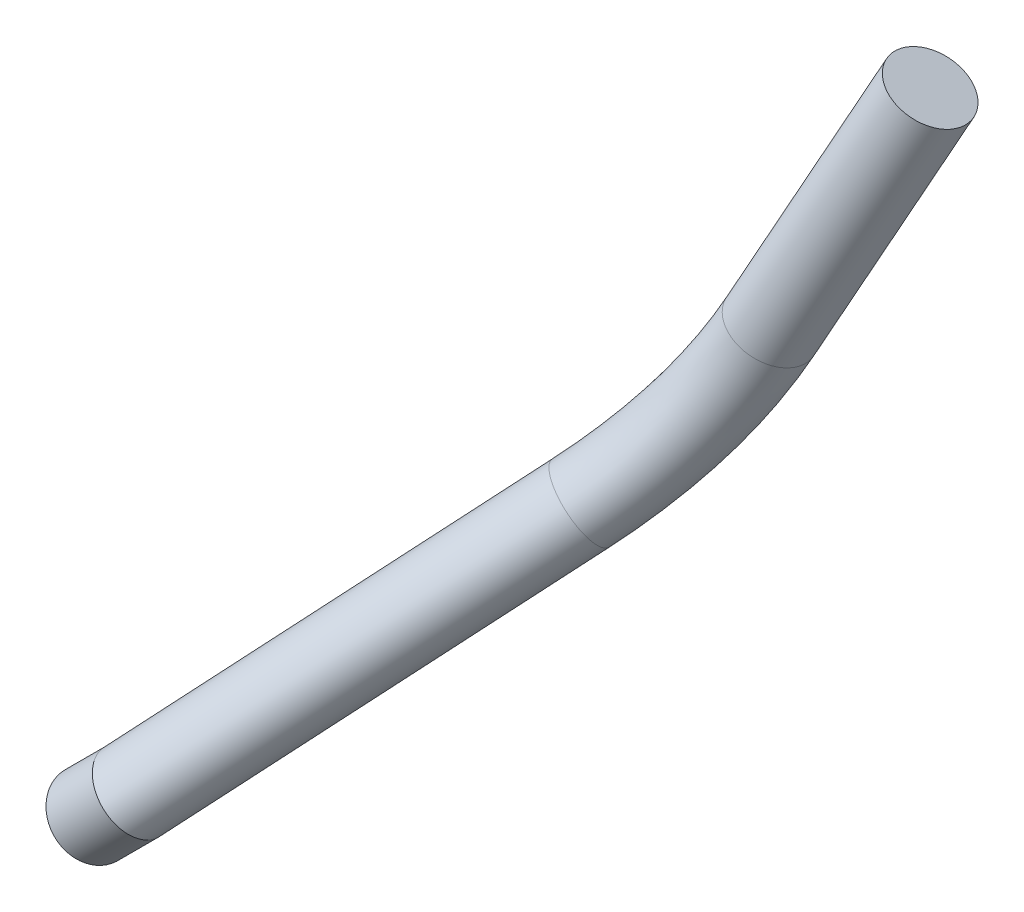
ISO-10303-21;
HEADER;
FILE_DESCRIPTION(('STEP AP214'),'2;1');
FILE_NAME('part.step','',(''),(''),'','','');
FILE_SCHEMA(('AUTOMOTIVE_DESIGN { 1 0 10303 214 1 1 1 1 }'));
ENDSEC;
DATA;
#1=APPLICATION_CONTEXT('core data for automotive mechanical design processes');
#2=APPLICATION_PROTOCOL_DEFINITION('international standard','automotive_design',2000,#1);
#3=PRODUCT_CONTEXT('',#1,'mechanical');
#4=PRODUCT('Part','Part','',(#3));
#5=PRODUCT_RELATED_PRODUCT_CATEGORY('part','',(#4));
#6=PRODUCT_DEFINITION_FORMATION('','',#4);
#7=PRODUCT_DEFINITION_CONTEXT('part definition',#1,'design');
#8=PRODUCT_DEFINITION('design','',#6,#7);
#9=PRODUCT_DEFINITION_SHAPE('','',#8);
#10=(LENGTH_UNIT() NAMED_UNIT(*) SI_UNIT(.MILLI.,.METRE.));
#11=(NAMED_UNIT(*) PLANE_ANGLE_UNIT() SI_UNIT($,.RADIAN.));
#12=(NAMED_UNIT(*) SI_UNIT($,.STERADIAN.) SOLID_ANGLE_UNIT());
#13=UNCERTAINTY_MEASURE_WITH_UNIT(LENGTH_MEASURE(1.E-05),#10,'distance_accuracy_value','');
#14=(GEOMETRIC_REPRESENTATION_CONTEXT(3) GLOBAL_UNCERTAINTY_ASSIGNED_CONTEXT((#13)) GLOBAL_UNIT_ASSIGNED_CONTEXT((#10,
#11,#12)) REPRESENTATION_CONTEXT('',''));
#15=CARTESIAN_POINT('',(0.,0.,0.));
#16=DIRECTION('',(0.,0.,1.));
#17=DIRECTION('',(1.,0.,0.));
#18=AXIS2_PLACEMENT_3D('',#15,#16,#17);
#19=CARTESIAN_POINT('',(193.010891229428,77.9168547777323,208.7608));
#20=DIRECTION('',(0.707106781186756,0.707106781186339,3.13292330996247E-13));
#21=DIRECTION('',(-0.707106781186339,0.707106781186756,0.));
#22=AXIS2_PLACEMENT_3D('',#19,#20,#21);
#23=PLANE('',#22);
#24=CARTESIAN_POINT('',(193.010891229428,77.9168547777323,208.7608));
#25=DIRECTION('',(0.707106781186756,0.707106781186339,3.13292330996247E-13));
#26=DIRECTION('',(-0.707106781186339,0.707106781186756,0.));
#27=AXIS2_PLACEMENT_3D('',#24,#25,#26);
#28=CIRCLE('',#27,4.69900000000001);
#29=CARTESIAN_POINT('',(189.688196464634,81.2395495425288,208.7608));
#30=VERTEX_POINT('',#29);
#31=EDGE_CURVE('E48',#30,#30,#28,.T.);
#32=ORIENTED_EDGE('',*,*,#31,.F.);
#33=EDGE_LOOP('',(#32));
#34=FACE_BOUND('',#33,.T.);
#35=ADVANCED_FACE('F45',(#34),#23,.F.);
#36=CARTESIAN_POINT('',(253.620262853488,165.140017683346,163.321796800787));
#37=DIRECTION('',(0.428619655044023,0.890066110551967,-0.155137068932078));
#38=DIRECTION('',(-0.884787750148492,0.448267243214211,0.127307171236739));
#39=AXIS2_PLACEMENT_3D('',#36,#37,#38);
#40=PLANE('',#39);
#41=CARTESIAN_POINT('',(253.620262853488,165.140017683346,163.321796800787));
#42=DIRECTION('',(0.428619655044023,0.890066110551967,-0.155137068932078));
#43=DIRECTION('',(-0.884787750148492,0.448267243214211,0.127307171236739));
#44=AXIS2_PLACEMENT_3D('',#41,#42,#43);
#45=CIRCLE('',#44,4.69900000000001);
#46=CARTESIAN_POINT('',(249.46264521554,167.246425459209,163.920013198429));
#47=VERTEX_POINT('',#46);
#48=EDGE_CURVE('E11',#47,#47,#45,.T.);
#49=ORIENTED_EDGE('',*,*,#48,.T.);
#50=EDGE_LOOP('',(#49));
#51=FACE_BOUND('',#50,.T.);
#52=ADVANCED_FACE('F71',(#51),#40,.T.);
#53=CARTESIAN_POINT('',(200.628540611571,85.534504159871,208.760800000004));
#54=DIRECTION('',(-0.707106781186754,-0.707106781186341,-3.21027944107266E-13));
#55=DIRECTION('',(0.707106781186341,-0.707106781186755,0.));
#56=AXIS2_PLACEMENT_3D('',#53,#54,#55);
#57=CYLINDRICAL_SURFACE('',#56,4.69900000000001);
#58=CARTESIAN_POINT('',(198.085125282214,82.9910888305151,208.760800000002));
#59=DIRECTION('',(-0.655206831817333,-0.68911242353775,0.309561101021789));
#60=DIRECTION('',(0.271450213578498,0.167646290258137,0.94773915341241));
#61=AXIS2_PLACEMENT_3D('',#58,#59,#60);
#62=ELLIPSE('',#61,4.94331201693354,4.69900000000001);
#63=CARTESIAN_POINT('',(199.426988384996,83.8198167517425,213.445770345984));
#64=VERTEX_POINT('',#63);
#65=EDGE_CURVE('E60',#64,#64,#62,.T.);
#66=ORIENTED_EDGE('',*,*,#65,.T.);
#67=EDGE_LOOP('',(#66));
#68=FACE_BOUND('',#67,.T.);
#69=ORIENTED_EDGE('',*,*,#31,.T.);
#70=EDGE_LOOP('',(#69));
#71=FACE_BOUND('',#70,.T.);
#72=ADVANCED_FACE('F68',(#68,#71),#57,.T.);
#73=CARTESIAN_POINT('',(253.620262853488,165.140017683346,163.321796800787));
#74=DIRECTION('',(-0.428619655044022,-0.890066110551969,0.15513706893207));
#75=DIRECTION('',(0.900974246616737,-0.433872569925092,0.));
#76=AXIS2_PLACEMENT_3D('',#73,#74,#75);
#77=CYLINDRICAL_SURFACE('',#76,4.69900000000001);
#78=CARTESIAN_POINT('',(238.754370819433,134.269695832898,168.702443465222));
#79=DIRECTION('',(0.428619655044023,0.890066110551967,-0.155137068932078));
#80=DIRECTION('',(-0.884787750148492,0.448267243214211,0.127307171236739));
#81=AXIS2_PLACEMENT_3D('',#78,#79,#80);
#82=CIRCLE('',#81,4.69900000000001);
#83=CARTESIAN_POINT('',(240.31776368646,132.788864141045,164.525896896137));
#84=VERTEX_POINT('',#83);
#85=EDGE_CURVE('E52',#84,#84,#82,.T.);
#86=ORIENTED_EDGE('',*,*,#85,.T.);
#87=EDGE_LOOP('',(#86));
#88=FACE_BOUND('',#87,.T.);
#89=ORIENTED_EDGE('',*,*,#48,.F.);
#90=EDGE_LOOP('',(#89));
#91=FACE_BOUND('',#90,.T.);
#92=ADVANCED_FACE('F83',(#88,#91),#77,.T.);
#93=CARTESIAN_POINT('',(221.852826311034,150.278687096171,213.854298266139));
#94=DIRECTION('',(-0.839994562362254,0.32934874712419,-0.431205911334215));
#95=DIRECTION('',(-0.456685129558831,0.,0.889628401322616));
#96=AXIS2_PLACEMENT_3D('',#93,#94,#95);
#97=TOROIDAL_SURFACE('',#96,50.8,4.69900000000001);
#98=CARTESIAN_POINT('',(225.215214034669,113.368458468325,179.112833538294));
#99=DIRECTION('',(0.538542650677155,0.603002419734615,-0.588523487378221));
#100=DIRECTION('',(-0.738523783431751,0.674064014374363,0.0148433766768233));
#101=AXIS2_PLACEMENT_3D('',#98,#99,#100);
#102=CIRCLE('',#101,4.69900000000001);
#103=CARTESIAN_POINT('',(225.526234899106,109.954262320249,175.899248050969));
#104=VERTEX_POINT('',#103);
#105=EDGE_CURVE('E57',#104,#104,#102,.T.);
#106=CARTESIAN_POINT('',(221.852826311034,150.278687096171,213.854298266139));
#107=DIRECTION('',(-0.839994562362254,0.32934874712419,-0.431205911334215));
#108=DIRECTION('',(-0.456685129558831,0.,0.889628401322616));
#109=AXIS2_PLACEMENT_3D('',#106,#107,#108);
#110=CIRCLE('',#109,55.499);
#111=EDGE_CURVE('',#84,#104,#110,.T.);
#112=ORIENTED_EDGE('',*,*,#85,.F.);
#113=ORIENTED_EDGE('',*,*,#105,.T.);
#114=ORIENTED_EDGE('',*,*,#111,.T.);
#115=ORIENTED_EDGE('',*,*,#111,.F.);
#116=EDGE_LOOP('',(#112,#114,#113,#115));
#117=FACE_BOUND('',#116,.T.);
#118=ADVANCED_FACE('F77',(#117),#97,.T.);
#119=CARTESIAN_POINT('',(225.215214034669,113.368458468325,179.112833538294));
#120=DIRECTION('',(-0.538542650677156,-0.60300241973462,0.588523487378215));
#121=DIRECTION('',(0.,-0.698462744662284,-0.715646417107519));
#122=AXIS2_PLACEMENT_3D('',#119,#120,#121);
#123=CYLINDRICAL_SURFACE('',#122,4.69900000000001);
#124=ORIENTED_EDGE('',*,*,#105,.F.);
#125=EDGE_LOOP('',(#124));
#126=FACE_BOUND('',#125,.T.);
#127=ORIENTED_EDGE('',*,*,#65,.F.);
#128=EDGE_LOOP('',(#127));
#129=FACE_BOUND('',#128,.T.);
#130=ADVANCED_FACE('F75',(#126,#129),#123,.T.);
#131=CLOSED_SHELL('',(#35,#52,#72,#92,#118,#130));
#132=MANIFOLD_SOLID_BREP('B2',#131);
#133=ADVANCED_BREP_SHAPE_REPRESENTATION('',(#18,#132),#14);
#134=SHAPE_DEFINITION_REPRESENTATION(#9,#133);
ENDSEC;
END-ISO-10303-21;
